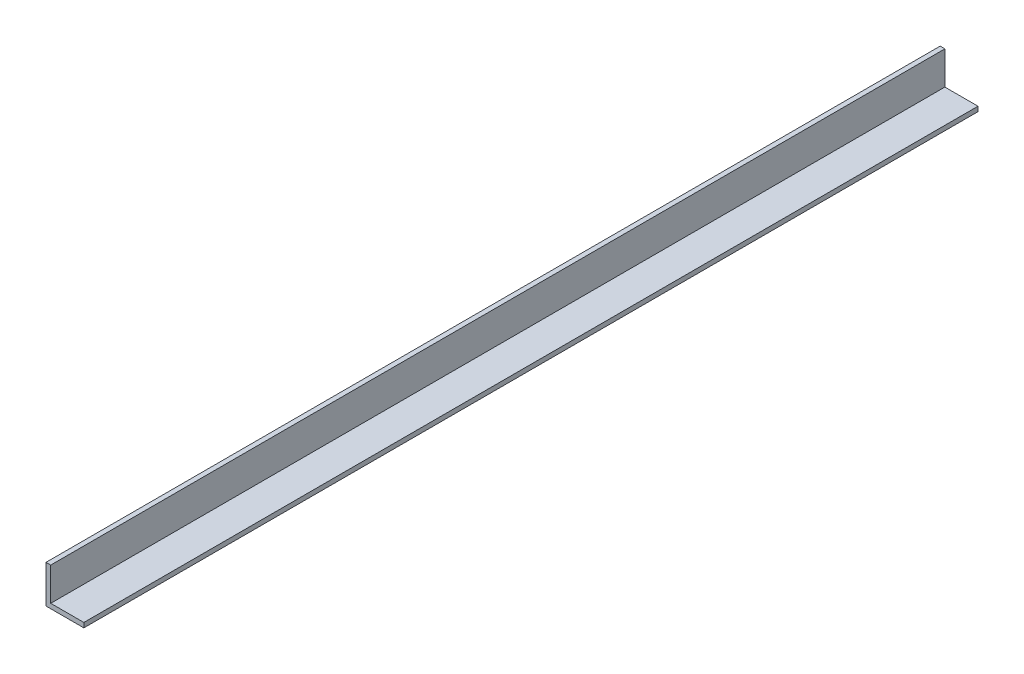
ISO-10303-21;
HEADER;
FILE_DESCRIPTION(('STEP AP214'),'2;1');
FILE_NAME('part.step','',(''),(''),'','','');
FILE_SCHEMA(('AUTOMOTIVE_DESIGN { 1 0 10303 214 1 1 1 1 }'));
ENDSEC;
DATA;
#1=APPLICATION_CONTEXT('core data for automotive mechanical design processes');
#2=APPLICATION_PROTOCOL_DEFINITION('international standard','automotive_design',2000,#1);
#3=PRODUCT_CONTEXT('',#1,'mechanical');
#4=PRODUCT('Part','Part','',(#3));
#5=PRODUCT_RELATED_PRODUCT_CATEGORY('part','',(#4));
#6=PRODUCT_DEFINITION_FORMATION('','',#4);
#7=PRODUCT_DEFINITION_CONTEXT('part definition',#1,'design');
#8=PRODUCT_DEFINITION('design','',#6,#7);
#9=PRODUCT_DEFINITION_SHAPE('','',#8);
#10=(LENGTH_UNIT() NAMED_UNIT(*) SI_UNIT(.MILLI.,.METRE.));
#11=(NAMED_UNIT(*) PLANE_ANGLE_UNIT() SI_UNIT($,.RADIAN.));
#12=(NAMED_UNIT(*) SI_UNIT($,.STERADIAN.) SOLID_ANGLE_UNIT());
#13=UNCERTAINTY_MEASURE_WITH_UNIT(LENGTH_MEASURE(1.E-05),#10,'distance_accuracy_value','');
#14=(GEOMETRIC_REPRESENTATION_CONTEXT(3) GLOBAL_UNCERTAINTY_ASSIGNED_CONTEXT((#13)) GLOBAL_UNIT_ASSIGNED_CONTEXT((#10,
#11,#12)) REPRESENTATION_CONTEXT('',''));
#15=CARTESIAN_POINT('',(0.,0.,0.));
#16=DIRECTION('',(0.,0.,1.));
#17=DIRECTION('',(1.,0.,0.));
#18=AXIS2_PLACEMENT_3D('',#15,#16,#17);
#19=CARTESIAN_POINT('',(3.175,3.175,1219.2));
#20=DIRECTION('',(-1.,0.,0.));
#21=DIRECTION('',(0.,-1.,0.));
#22=AXIS2_PLACEMENT_3D('',#19,#20,#21);
#23=PLANE('',#22);
#24=DIRECTION('',(0.,0.,-1.));
#25=VECTOR('',#24,1.);
#26=CARTESIAN_POINT('',(3.175,25.4,1219.2));
#27=LINE('',#26,#25);
#28=CARTESIAN_POINT('',(3.175,25.4,1219.2));
#29=VERTEX_POINT('',#28);
#30=CARTESIAN_POINT('',(3.17500000000002,25.4,619.2));
#31=VERTEX_POINT('',#30);
#32=EDGE_CURVE('E11',#29,#31,#27,.T.);
#33=ORIENTED_EDGE('',*,*,#32,.F.);
#34=DIRECTION('',(0.,1.,0.));
#35=VECTOR('',#34,1.);
#36=CARTESIAN_POINT('',(3.175,3.175,1219.2));
#37=LINE('',#36,#35);
#38=CARTESIAN_POINT('',(3.175,3.175,1219.2));
#39=VERTEX_POINT('',#38);
#40=EDGE_CURVE('E101',#39,#29,#37,.T.);
#41=ORIENTED_EDGE('',*,*,#40,.F.);
#42=DIRECTION('',(0.,0.,-1.));
#43=VECTOR('',#42,1.);
#44=CARTESIAN_POINT('',(3.175,3.175,1319.2));
#45=LINE('',#44,#43);
#46=CARTESIAN_POINT('',(3.175,3.175,619.2));
#47=VERTEX_POINT('',#46);
#48=EDGE_CURVE('E109',#39,#47,#45,.T.);
#49=ORIENTED_EDGE('',*,*,#48,.T.);
#50=DIRECTION('',(0.,1.,0.));
#51=VECTOR('',#50,1.);
#52=CARTESIAN_POINT('',(3.175,3.175,619.2));
#53=LINE('',#52,#51);
#54=EDGE_CURVE('E91',#47,#31,#53,.T.);
#55=ORIENTED_EDGE('',*,*,#54,.T.);
#56=EDGE_LOOP('',(#33,#41,#49,#55));
#57=FACE_BOUND('',#56,.T.);
#58=ADVANCED_FACE('F41',(#57),#23,.F.);
#59=CARTESIAN_POINT('',(3.175,25.4,1219.2));
#60=DIRECTION('',(0.,-1.,0.));
#61=DIRECTION('',(1.,0.,0.));
#62=AXIS2_PLACEMENT_3D('',#59,#60,#61);
#63=PLANE('',#62);
#64=ORIENTED_EDGE('',*,*,#32,.T.);
#65=DIRECTION('',(-1.,0.,0.));
#66=VECTOR('',#65,1.);
#67=CARTESIAN_POINT('',(60.,25.4,619.2));
#68=LINE('',#67,#66);
#69=CARTESIAN_POINT('',(0.,25.4,619.2));
#70=VERTEX_POINT('',#69);
#71=EDGE_CURVE('E97',#31,#70,#68,.T.);
#72=ORIENTED_EDGE('',*,*,#71,.T.);
#73=DIRECTION('',(0.,0.,-1.));
#74=VECTOR('',#73,1.);
#75=CARTESIAN_POINT('',(0.,25.4,1219.2));
#76=LINE('',#75,#74);
#77=CARTESIAN_POINT('',(0.,25.4,1219.2));
#78=VERTEX_POINT('',#77);
#79=EDGE_CURVE('E48',#78,#70,#76,.T.);
#80=ORIENTED_EDGE('',*,*,#79,.F.);
#81=DIRECTION('',(-1.,0.,0.));
#82=VECTOR('',#81,1.);
#83=CARTESIAN_POINT('',(3.175,25.4,1219.2));
#84=LINE('',#83,#82);
#85=EDGE_CURVE('E123',#29,#78,#84,.T.);
#86=ORIENTED_EDGE('',*,*,#85,.F.);
#87=EDGE_LOOP('',(#64,#72,#80,#86));
#88=FACE_BOUND('',#87,.T.);
#89=ADVANCED_FACE('F146',(#88),#63,.F.);
#90=CARTESIAN_POINT('',(0.,25.4,1219.2));
#91=DIRECTION('',(1.,0.,0.));
#92=DIRECTION('',(0.,1.,0.));
#93=AXIS2_PLACEMENT_3D('',#90,#91,#92);
#94=PLANE('',#93);
#95=ORIENTED_EDGE('',*,*,#79,.T.);
#96=DIRECTION('',(0.,1.,0.));
#97=VECTOR('',#96,1.);
#98=CARTESIAN_POINT('',(0.,25.4,619.2));
#99=LINE('',#98,#97);
#100=CARTESIAN_POINT('',(0.,0.,619.2));
#101=VERTEX_POINT('',#100);
#102=EDGE_CURVE('E114',#101,#70,#99,.T.);
#103=ORIENTED_EDGE('',*,*,#102,.F.);
#104=DIRECTION('',(0.,0.,-1.));
#105=VECTOR('',#104,1.);
#106=CARTESIAN_POINT('',(0.,0.,1219.2));
#107=LINE('',#106,#105);
#108=CARTESIAN_POINT('',(0.,0.,1219.2));
#109=VERTEX_POINT('',#108);
#110=EDGE_CURVE('E135',#109,#101,#107,.T.);
#111=ORIENTED_EDGE('',*,*,#110,.F.);
#112=DIRECTION('',(0.,-1.,0.));
#113=VECTOR('',#112,1.);
#114=CARTESIAN_POINT('',(0.,25.4,1219.2));
#115=LINE('',#114,#113);
#116=EDGE_CURVE('E125',#78,#109,#115,.T.);
#117=ORIENTED_EDGE('',*,*,#116,.F.);
#118=EDGE_LOOP('',(#95,#103,#111,#117));
#119=FACE_BOUND('',#118,.T.);
#120=ADVANCED_FACE('F142',(#119),#94,.F.);
#121=CARTESIAN_POINT('',(0.,0.,1219.2));
#122=DIRECTION('',(0.,1.,0.));
#123=DIRECTION('',(0.,0.,1.));
#124=AXIS2_PLACEMENT_3D('',#121,#122,#123);
#125=PLANE('',#124);
#126=ORIENTED_EDGE('',*,*,#110,.T.);
#127=DIRECTION('',(1.,0.,0.));
#128=VECTOR('',#127,1.);
#129=CARTESIAN_POINT('',(0.,0.,619.2));
#130=LINE('',#129,#128);
#131=CARTESIAN_POINT('',(25.4,0.,619.2));
#132=VERTEX_POINT('',#131);
#133=EDGE_CURVE('E102',#101,#132,#130,.T.);
#134=ORIENTED_EDGE('',*,*,#133,.T.);
#135=DIRECTION('',(0.,0.,-1.));
#136=VECTOR('',#135,1.);
#137=CARTESIAN_POINT('',(25.4,0.,1219.2));
#138=LINE('',#137,#136);
#139=CARTESIAN_POINT('',(25.4,0.,1219.2));
#140=VERTEX_POINT('',#139);
#141=EDGE_CURVE('E132',#140,#132,#138,.T.);
#142=ORIENTED_EDGE('',*,*,#141,.F.);
#143=DIRECTION('',(1.,0.,0.));
#144=VECTOR('',#143,1.);
#145=CARTESIAN_POINT('',(0.,0.,1219.2));
#146=LINE('',#145,#144);
#147=EDGE_CURVE('E60',#109,#140,#146,.T.);
#148=ORIENTED_EDGE('',*,*,#147,.F.);
#149=EDGE_LOOP('',(#126,#134,#142,#148));
#150=FACE_BOUND('',#149,.T.);
#151=ADVANCED_FACE('F149',(#150),#125,.F.);
#152=CARTESIAN_POINT('',(25.4,0.,1219.2));
#153=DIRECTION('',(-1.,0.,0.));
#154=DIRECTION('',(0.,0.,1.));
#155=AXIS2_PLACEMENT_3D('',#152,#153,#154);
#156=PLANE('',#155);
#157=ORIENTED_EDGE('',*,*,#141,.T.);
#158=DIRECTION('',(0.,1.,0.));
#159=VECTOR('',#158,1.);
#160=CARTESIAN_POINT('',(25.4,0.,619.2));
#161=LINE('',#160,#159);
#162=CARTESIAN_POINT('',(25.4,3.175,619.2));
#163=VERTEX_POINT('',#162);
#164=EDGE_CURVE('E111',#132,#163,#161,.T.);
#165=ORIENTED_EDGE('',*,*,#164,.T.);
#166=DIRECTION('',(0.,0.,-1.));
#167=VECTOR('',#166,1.);
#168=CARTESIAN_POINT('',(25.4,3.175,1219.2));
#169=LINE('',#168,#167);
#170=CARTESIAN_POINT('',(25.4,3.175,1219.2));
#171=VERTEX_POINT('',#170);
#172=EDGE_CURVE('E110',#171,#163,#169,.T.);
#173=ORIENTED_EDGE('',*,*,#172,.F.);
#174=DIRECTION('',(0.,1.,0.));
#175=VECTOR('',#174,1.);
#176=CARTESIAN_POINT('',(25.4,0.,1219.2));
#177=LINE('',#176,#175);
#178=EDGE_CURVE('E55',#140,#171,#177,.T.);
#179=ORIENTED_EDGE('',*,*,#178,.F.);
#180=EDGE_LOOP('',(#157,#165,#173,#179));
#181=FACE_BOUND('',#180,.T.);
#182=ADVANCED_FACE('F151',(#181),#156,.F.);
#183=CARTESIAN_POINT('',(25.4,3.175,1219.2));
#184=DIRECTION('',(0.,-1.,0.));
#185=DIRECTION('',(1.,0.,0.));
#186=AXIS2_PLACEMENT_3D('',#183,#184,#185);
#187=PLANE('',#186);
#188=DIRECTION('',(-1.,0.,0.));
#189=VECTOR('',#188,1.);
#190=CARTESIAN_POINT('',(25.4,3.175,619.2));
#191=LINE('',#190,#189);
#192=EDGE_CURVE('E94',#163,#47,#191,.T.);
#193=ORIENTED_EDGE('',*,*,#192,.T.);
#194=ORIENTED_EDGE('',*,*,#48,.F.);
#195=DIRECTION('',(-1.,0.,0.));
#196=VECTOR('',#195,1.);
#197=CARTESIAN_POINT('',(25.4,3.175,1219.2));
#198=LINE('',#197,#196);
#199=EDGE_CURVE('E129',#171,#39,#198,.T.);
#200=ORIENTED_EDGE('',*,*,#199,.F.);
#201=ORIENTED_EDGE('',*,*,#172,.T.);
#202=EDGE_LOOP('',(#193,#194,#200,#201));
#203=FACE_BOUND('',#202,.T.);
#204=ADVANCED_FACE('F107',(#203),#187,.F.);
#205=CARTESIAN_POINT('',(0.,0.,1219.2));
#206=DIRECTION('',(0.,0.,1.));
#207=DIRECTION('',(1.,0.,0.));
#208=AXIS2_PLACEMENT_3D('',#205,#206,#207);
#209=PLANE('',#208);
#210=ORIENTED_EDGE('',*,*,#199,.T.);
#211=ORIENTED_EDGE('',*,*,#40,.T.);
#212=ORIENTED_EDGE('',*,*,#85,.T.);
#213=ORIENTED_EDGE('',*,*,#116,.T.);
#214=ORIENTED_EDGE('',*,*,#147,.T.);
#215=ORIENTED_EDGE('',*,*,#178,.T.);
#216=EDGE_LOOP('',(#210,#211,#212,#213,#214,#215));
#217=FACE_BOUND('',#216,.T.);
#218=ADVANCED_FACE('F147',(#217),#209,.T.);
#219=CARTESIAN_POINT('',(60.,25.4,619.2));
#220=DIRECTION('',(0.,0.,1.));
#221=DIRECTION('',(1.,0.,0.));
#222=AXIS2_PLACEMENT_3D('',#219,#220,#221);
#223=PLANE('',#222);
#224=ORIENTED_EDGE('',*,*,#54,.F.);
#225=ORIENTED_EDGE('',*,*,#192,.F.);
#226=ORIENTED_EDGE('',*,*,#164,.F.);
#227=ORIENTED_EDGE('',*,*,#133,.F.);
#228=ORIENTED_EDGE('',*,*,#102,.T.);
#229=ORIENTED_EDGE('',*,*,#71,.F.);
#230=EDGE_LOOP('',(#224,#225,#226,#227,#228,#229));
#231=FACE_BOUND('',#230,.T.);
#232=ADVANCED_FACE('F93',(#231),#223,.F.);
#233=CLOSED_SHELL('',(#58,#89,#120,#151,#182,#204,#218,#232));
#234=MANIFOLD_SOLID_BREP('B2',#233);
#235=ADVANCED_BREP_SHAPE_REPRESENTATION('',(#18,#234),#14);
#236=SHAPE_DEFINITION_REPRESENTATION(#9,#235);
ENDSEC;
END-ISO-10303-21;
